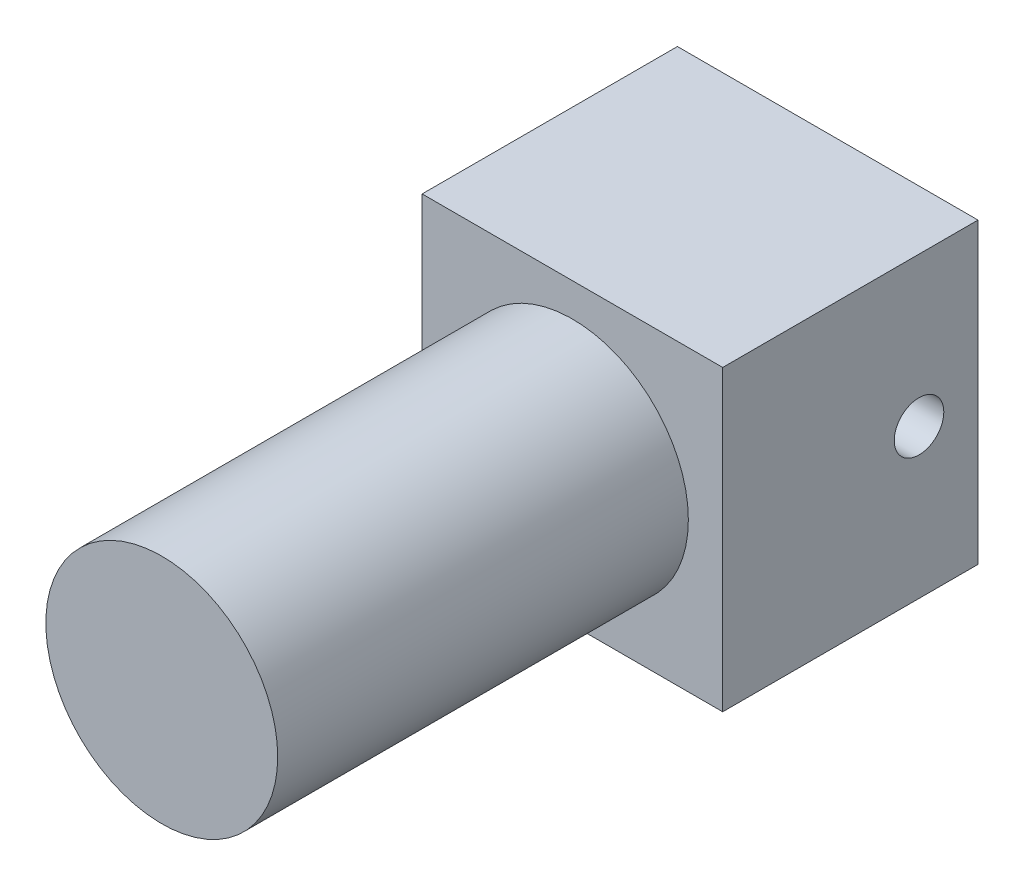
ISO-10303-21;
HEADER;
FILE_DESCRIPTION(('STEP AP214'),'2;1');
FILE_NAME('part.step','',(''),(''),'','','');
FILE_SCHEMA(('AUTOMOTIVE_DESIGN { 1 0 10303 214 1 1 1 1 }'));
ENDSEC;
DATA;
#1=APPLICATION_CONTEXT('core data for automotive mechanical design processes');
#2=APPLICATION_PROTOCOL_DEFINITION('international standard','automotive_design',2000,#1);
#3=PRODUCT_CONTEXT('',#1,'mechanical');
#4=PRODUCT('Part','Part','',(#3));
#5=PRODUCT_RELATED_PRODUCT_CATEGORY('part','',(#4));
#6=PRODUCT_DEFINITION_FORMATION('','',#4);
#7=PRODUCT_DEFINITION_CONTEXT('part definition',#1,'design');
#8=PRODUCT_DEFINITION('design','',#6,#7);
#9=PRODUCT_DEFINITION_SHAPE('','',#8);
#10=(LENGTH_UNIT() NAMED_UNIT(*) SI_UNIT(.MILLI.,.METRE.));
#11=(NAMED_UNIT(*) PLANE_ANGLE_UNIT() SI_UNIT($,.RADIAN.));
#12=(NAMED_UNIT(*) SI_UNIT($,.STERADIAN.) SOLID_ANGLE_UNIT());
#13=UNCERTAINTY_MEASURE_WITH_UNIT(LENGTH_MEASURE(1.E-05),#10,'distance_accuracy_value','');
#14=(GEOMETRIC_REPRESENTATION_CONTEXT(3) GLOBAL_UNCERTAINTY_ASSIGNED_CONTEXT((#13)) GLOBAL_UNIT_ASSIGNED_CONTEXT((#10,
#11,#12)) REPRESENTATION_CONTEXT('',''));
#15=CARTESIAN_POINT('',(0.,0.,0.));
#16=DIRECTION('',(0.,0.,1.));
#17=DIRECTION('',(1.,0.,0.));
#18=AXIS2_PLACEMENT_3D('',#15,#16,#17);
#19=CARTESIAN_POINT('',(19.25,-19.1,32.7));
#20=DIRECTION('',(-1.,0.,0.));
#21=DIRECTION('',(0.,0.,1.));
#22=AXIS2_PLACEMENT_3D('',#19,#20,#21);
#23=PLANE('',#22);
#24=CARTESIAN_POINT('',(19.25,0.,7.55431960739264));
#25=DIRECTION('',(1.,0.,0.));
#26=DIRECTION('',(0.,0.,-1.));
#27=AXIS2_PLACEMENT_3D('',#24,#25,#26);
#28=CIRCLE('',#27,3.175);
#29=CARTESIAN_POINT('',(19.25,0.,4.37931960739264));
#30=VERTEX_POINT('',#29);
#31=EDGE_CURVE('E135',#30,#30,#28,.T.);
#32=ORIENTED_EDGE('',*,*,#31,.F.);
#33=EDGE_LOOP('',(#32));
#34=FACE_BOUND('',#33,.T.);
#35=DIRECTION('',(0.,1.,0.));
#36=VECTOR('',#35,1.);
#37=CARTESIAN_POINT('',(19.25,-19.1,0.));
#38=LINE('',#37,#36);
#39=CARTESIAN_POINT('',(19.25,-19.1,0.));
#40=VERTEX_POINT('',#39);
#41=CARTESIAN_POINT('',(19.25,19.1,0.));
#42=VERTEX_POINT('',#41);
#43=EDGE_CURVE('E110',#40,#42,#38,.T.);
#44=ORIENTED_EDGE('',*,*,#43,.T.);
#45=DIRECTION('',(0.,0.,-1.));
#46=VECTOR('',#45,1.);
#47=CARTESIAN_POINT('',(19.25,19.1,32.7));
#48=LINE('',#47,#46);
#49=CARTESIAN_POINT('',(19.25,19.1,32.7));
#50=VERTEX_POINT('',#49);
#51=EDGE_CURVE('E42',#50,#42,#48,.T.);
#52=ORIENTED_EDGE('',*,*,#51,.F.);
#53=DIRECTION('',(0.,1.,0.));
#54=VECTOR('',#53,1.);
#55=CARTESIAN_POINT('',(19.25,-19.1,32.7));
#56=LINE('',#55,#54);
#57=CARTESIAN_POINT('',(19.25,-19.1,32.7));
#58=VERTEX_POINT('',#57);
#59=EDGE_CURVE('E93',#58,#50,#56,.T.);
#60=ORIENTED_EDGE('',*,*,#59,.F.);
#61=DIRECTION('',(0.,0.,-1.));
#62=VECTOR('',#61,1.);
#63=CARTESIAN_POINT('',(19.25,-19.1,32.7));
#64=LINE('',#63,#62);
#65=EDGE_CURVE('E106',#58,#40,#64,.T.);
#66=ORIENTED_EDGE('',*,*,#65,.T.);
#67=EDGE_LOOP('',(#44,#52,#60,#66));
#68=FACE_BOUND('',#67,.T.);
#69=ADVANCED_FACE('F39',(#34,#68),#23,.F.);
#70=CARTESIAN_POINT('',(-19.25,19.1,32.7));
#71=DIRECTION('',(0.,-1.,0.));
#72=DIRECTION('',(0.,0.,-1.));
#73=AXIS2_PLACEMENT_3D('',#70,#71,#72);
#74=PLANE('',#73);
#75=DIRECTION('',(-1.,0.,0.));
#76=VECTOR('',#75,1.);
#77=CARTESIAN_POINT('',(-19.25,19.1,0.));
#78=LINE('',#77,#76);
#79=CARTESIAN_POINT('',(-19.25,19.1,0.));
#80=VERTEX_POINT('',#79);
#81=EDGE_CURVE('E99',#42,#80,#78,.T.);
#82=ORIENTED_EDGE('',*,*,#81,.T.);
#83=DIRECTION('',(0.,0.,-1.));
#84=VECTOR('',#83,1.);
#85=CARTESIAN_POINT('',(-19.25,19.1,32.7));
#86=LINE('',#85,#84);
#87=CARTESIAN_POINT('',(-19.25,19.1,32.7));
#88=VERTEX_POINT('',#87);
#89=EDGE_CURVE('E97',#88,#80,#86,.T.);
#90=ORIENTED_EDGE('',*,*,#89,.F.);
#91=DIRECTION('',(-1.,0.,0.));
#92=VECTOR('',#91,1.);
#93=CARTESIAN_POINT('',(-19.25,19.1,32.7));
#94=LINE('',#93,#92);
#95=EDGE_CURVE('E88',#50,#88,#94,.T.);
#96=ORIENTED_EDGE('',*,*,#95,.F.);
#97=ORIENTED_EDGE('',*,*,#51,.T.);
#98=EDGE_LOOP('',(#82,#90,#96,#97));
#99=FACE_BOUND('',#98,.T.);
#100=ADVANCED_FACE('F98',(#99),#74,.F.);
#101=CARTESIAN_POINT('',(-19.25,-19.1,32.7));
#102=DIRECTION('',(1.,0.,0.));
#103=DIRECTION('',(0.,0.,-1.));
#104=AXIS2_PLACEMENT_3D('',#101,#102,#103);
#105=PLANE('',#104);
#106=CARTESIAN_POINT('',(-19.25,0.,7.55431960739264));
#107=DIRECTION('',(1.,0.,0.));
#108=DIRECTION('',(0.,0.,-1.));
#109=AXIS2_PLACEMENT_3D('',#106,#107,#108);
#110=CIRCLE('',#109,3.175);
#111=CARTESIAN_POINT('',(-19.25,0.,4.37931960739264));
#112=VERTEX_POINT('',#111);
#113=EDGE_CURVE('E143',#112,#112,#110,.T.);
#114=ORIENTED_EDGE('',*,*,#113,.T.);
#115=EDGE_LOOP('',(#114));
#116=FACE_BOUND('',#115,.T.);
#117=DIRECTION('',(0.,-1.,0.));
#118=VECTOR('',#117,1.);
#119=CARTESIAN_POINT('',(-19.25,-19.1,0.));
#120=LINE('',#119,#118);
#121=CARTESIAN_POINT('',(-19.25,-19.1,0.));
#122=VERTEX_POINT('',#121);
#123=EDGE_CURVE('E74',#80,#122,#120,.T.);
#124=ORIENTED_EDGE('',*,*,#123,.T.);
#125=DIRECTION('',(0.,0.,-1.));
#126=VECTOR('',#125,1.);
#127=CARTESIAN_POINT('',(-19.25,-19.1,32.7));
#128=LINE('',#127,#126);
#129=CARTESIAN_POINT('',(-19.25,-19.1,32.7));
#130=VERTEX_POINT('',#129);
#131=EDGE_CURVE('E101',#130,#122,#128,.T.);
#132=ORIENTED_EDGE('',*,*,#131,.F.);
#133=DIRECTION('',(0.,-1.,0.));
#134=VECTOR('',#133,1.);
#135=CARTESIAN_POINT('',(-19.25,-19.1,32.7));
#136=LINE('',#135,#134);
#137=EDGE_CURVE('E91',#88,#130,#136,.T.);
#138=ORIENTED_EDGE('',*,*,#137,.F.);
#139=ORIENTED_EDGE('',*,*,#89,.T.);
#140=EDGE_LOOP('',(#124,#132,#138,#139));
#141=FACE_BOUND('',#140,.T.);
#142=ADVANCED_FACE('F102',(#116,#141),#105,.F.);
#143=CARTESIAN_POINT('',(-19.25,-19.1,32.7));
#144=DIRECTION('',(0.,1.,0.));
#145=DIRECTION('',(0.,0.,1.));
#146=AXIS2_PLACEMENT_3D('',#143,#144,#145);
#147=PLANE('',#146);
#148=DIRECTION('',(1.,0.,0.));
#149=VECTOR('',#148,1.);
#150=CARTESIAN_POINT('',(-19.25,-19.1,0.));
#151=LINE('',#150,#149);
#152=EDGE_CURVE('E80',#122,#40,#151,.T.);
#153=ORIENTED_EDGE('',*,*,#152,.T.);
#154=ORIENTED_EDGE('',*,*,#65,.F.);
#155=DIRECTION('',(1.,0.,0.));
#156=VECTOR('',#155,1.);
#157=CARTESIAN_POINT('',(-19.25,-19.1,32.7));
#158=LINE('',#157,#156);
#159=EDGE_CURVE('E57',#130,#58,#158,.T.);
#160=ORIENTED_EDGE('',*,*,#159,.F.);
#161=ORIENTED_EDGE('',*,*,#131,.T.);
#162=EDGE_LOOP('',(#153,#154,#160,#161));
#163=FACE_BOUND('',#162,.T.);
#164=ADVANCED_FACE('F124',(#163),#147,.F.);
#165=CARTESIAN_POINT('',(0.,0.,32.7));
#166=DIRECTION('',(0.,0.,-1.));
#167=DIRECTION('',(-1.,0.,0.));
#168=AXIS2_PLACEMENT_3D('',#165,#166,#167);
#169=PLANE('',#168);
#170=CARTESIAN_POINT('',(0.,0.,32.7));
#171=DIRECTION('',(0.,0.,1.));
#172=DIRECTION('',(1.,0.,0.));
#173=AXIS2_PLACEMENT_3D('',#170,#171,#172);
#174=CIRCLE('',#173,14.85);
#175=CARTESIAN_POINT('',(14.85,0.,32.7));
#176=VERTEX_POINT('',#175);
#177=EDGE_CURVE('E11',#176,#176,#174,.T.);
#178=ORIENTED_EDGE('',*,*,#177,.F.);
#179=EDGE_LOOP('',(#178));
#180=FACE_BOUND('',#179,.T.);
#181=ORIENTED_EDGE('',*,*,#59,.T.);
#182=ORIENTED_EDGE('',*,*,#95,.T.);
#183=ORIENTED_EDGE('',*,*,#137,.T.);
#184=ORIENTED_EDGE('',*,*,#159,.T.);
#185=EDGE_LOOP('',(#181,#182,#183,#184));
#186=FACE_BOUND('',#185,.T.);
#187=ADVANCED_FACE('F89',(#180,#186),#169,.F.);
#188=CARTESIAN_POINT('',(0.,0.,0.));
#189=DIRECTION('',(0.,0.,-1.));
#190=DIRECTION('',(-1.,0.,0.));
#191=AXIS2_PLACEMENT_3D('',#188,#189,#190);
#192=PLANE('',#191);
#193=CARTESIAN_POINT('',(0.,-16.6516003268431,0.));
#194=DIRECTION('',(0.,0.,-1.));
#195=DIRECTION('',(-1.,0.,0.));
#196=AXIS2_PLACEMENT_3D('',#193,#194,#195);
#197=CIRCLE('',#196,2.06599733983125);
#198=CARTESIAN_POINT('',(-2.06599733983125,-16.6516003268431,0.));
#199=VERTEX_POINT('',#198);
#200=EDGE_CURVE('E151',#199,#199,#197,.T.);
#201=ORIENTED_EDGE('',*,*,#200,.F.);
#202=EDGE_LOOP('',(#201));
#203=FACE_BOUND('',#202,.T.);
#204=ORIENTED_EDGE('',*,*,#43,.F.);
#205=ORIENTED_EDGE('',*,*,#152,.F.);
#206=ORIENTED_EDGE('',*,*,#123,.F.);
#207=ORIENTED_EDGE('',*,*,#81,.F.);
#208=EDGE_LOOP('',(#204,#205,#206,#207));
#209=FACE_BOUND('',#208,.T.);
#210=ADVANCED_FACE('F127',(#203,#209),#192,.T.);
#211=CARTESIAN_POINT('',(0.,0.,85.3));
#212=DIRECTION('',(0.,0.,-1.));
#213=DIRECTION('',(-1.,0.,0.));
#214=AXIS2_PLACEMENT_3D('',#211,#212,#213);
#215=CYLINDRICAL_SURFACE('',#214,14.85);
#216=CARTESIAN_POINT('',(0.,0.,85.3));
#217=DIRECTION('',(0.,0.,1.));
#218=DIRECTION('',(1.,0.,0.));
#219=AXIS2_PLACEMENT_3D('',#216,#217,#218);
#220=CIRCLE('',#219,14.85);
#221=CARTESIAN_POINT('',(14.85,0.,85.3));
#222=VERTEX_POINT('',#221);
#223=EDGE_CURVE('E114',#222,#222,#220,.T.);
#224=ORIENTED_EDGE('',*,*,#223,.F.);
#225=EDGE_LOOP('',(#224));
#226=FACE_BOUND('',#225,.T.);
#227=ORIENTED_EDGE('',*,*,#177,.T.);
#228=EDGE_LOOP('',(#227));
#229=FACE_BOUND('',#228,.T.);
#230=ADVANCED_FACE('F169',(#226,#229),#215,.T.);
#231=CARTESIAN_POINT('',(0.,0.,85.3));
#232=DIRECTION('',(0.,0.,1.));
#233=DIRECTION('',(1.,0.,0.));
#234=AXIS2_PLACEMENT_3D('',#231,#232,#233);
#235=PLANE('',#234);
#236=ORIENTED_EDGE('',*,*,#223,.T.);
#237=EDGE_LOOP('',(#236));
#238=FACE_BOUND('',#237,.T.);
#239=ADVANCED_FACE('F176',(#238),#235,.T.);
#240=CARTESIAN_POINT('',(12.0364,0.,7.55431960739264));
#241=DIRECTION('',(1.,0.,0.));
#242=DIRECTION('',(0.,0.,-1.));
#243=AXIS2_PLACEMENT_3D('',#240,#241,#242);
#244=CYLINDRICAL_SURFACE('',#243,3.175);
#245=CARTESIAN_POINT('',(12.0364,0.,7.55431960739264));
#246=DIRECTION('',(1.,0.,0.));
#247=DIRECTION('',(0.,0.,-1.));
#248=AXIS2_PLACEMENT_3D('',#245,#246,#247);
#249=CIRCLE('',#248,3.175);
#250=CARTESIAN_POINT('',(12.0364,0.,4.37931960739264));
#251=VERTEX_POINT('',#250);
#252=EDGE_CURVE('E134',#251,#251,#249,.T.);
#253=ORIENTED_EDGE('',*,*,#252,.F.);
#254=EDGE_LOOP('',(#253));
#255=FACE_BOUND('',#254,.T.);
#256=ORIENTED_EDGE('',*,*,#31,.T.);
#257=EDGE_LOOP('',(#256));
#258=FACE_BOUND('',#257,.T.);
#259=ADVANCED_FACE('F192',(#255,#258),#244,.F.);
#260=CARTESIAN_POINT('',(12.0364,0.,7.55431960739264));
#261=DIRECTION('',(1.,0.,0.));
#262=DIRECTION('',(0.,0.,-1.));
#263=AXIS2_PLACEMENT_3D('',#260,#261,#262);
#264=PLANE('',#263);
#265=ORIENTED_EDGE('',*,*,#252,.T.);
#266=EDGE_LOOP('',(#265));
#267=FACE_BOUND('',#266,.T.);
#268=ADVANCED_FACE('F194',(#267),#264,.T.);
#269=CARTESIAN_POINT('',(-12.0364,0.,7.55431960739264));
#270=DIRECTION('',(-1.,0.,0.));
#271=DIRECTION('',(0.,0.,1.));
#272=AXIS2_PLACEMENT_3D('',#269,#270,#271);
#273=CYLINDRICAL_SURFACE('',#272,3.175);
#274=CARTESIAN_POINT('',(-12.0364,0.,7.55431960739264));
#275=DIRECTION('',(1.,0.,0.));
#276=DIRECTION('',(0.,0.,-1.));
#277=AXIS2_PLACEMENT_3D('',#274,#275,#276);
#278=CIRCLE('',#277,3.175);
#279=CARTESIAN_POINT('',(-12.0364,0.,4.37931960739264));
#280=VERTEX_POINT('',#279);
#281=EDGE_CURVE('E139',#280,#280,#278,.T.);
#282=ORIENTED_EDGE('',*,*,#281,.T.);
#283=EDGE_LOOP('',(#282));
#284=FACE_BOUND('',#283,.T.);
#285=ORIENTED_EDGE('',*,*,#113,.F.);
#286=EDGE_LOOP('',(#285));
#287=FACE_BOUND('',#286,.T.);
#288=ADVANCED_FACE('F200',(#284,#287),#273,.F.);
#289=CARTESIAN_POINT('',(-12.0364,0.,7.55431960739264));
#290=DIRECTION('',(-1.,0.,0.));
#291=DIRECTION('',(0.,0.,-1.));
#292=AXIS2_PLACEMENT_3D('',#289,#290,#291);
#293=PLANE('',#292);
#294=ORIENTED_EDGE('',*,*,#281,.F.);
#295=EDGE_LOOP('',(#294));
#296=FACE_BOUND('',#295,.T.);
#297=ADVANCED_FACE('F164',(#296),#293,.T.);
#298=CARTESIAN_POINT('',(0.,-16.6516003268431,-5.08));
#299=DIRECTION('',(0.,0.,1.));
#300=DIRECTION('',(1.,0.,0.));
#301=AXIS2_PLACEMENT_3D('',#298,#299,#300);
#302=CYLINDRICAL_SURFACE('',#301,2.06599733983125);
#303=CARTESIAN_POINT('',(0.,-16.6516003268431,-5.08));
#304=DIRECTION('',(0.,0.,-1.));
#305=DIRECTION('',(-1.,0.,0.));
#306=AXIS2_PLACEMENT_3D('',#303,#304,#305);
#307=CIRCLE('',#306,2.06599733983125);
#308=CARTESIAN_POINT('',(-2.06599733983125,-16.6516003268431,-5.08));
#309=VERTEX_POINT('',#308);
#310=EDGE_CURVE('E147',#309,#309,#307,.T.);
#311=ORIENTED_EDGE('',*,*,#310,.F.);
#312=EDGE_LOOP('',(#311));
#313=FACE_BOUND('',#312,.T.);
#314=ORIENTED_EDGE('',*,*,#200,.T.);
#315=EDGE_LOOP('',(#314));
#316=FACE_BOUND('',#315,.T.);
#317=ADVANCED_FACE('F161',(#313,#316),#302,.T.);
#318=CARTESIAN_POINT('',(0.,-16.6516003268431,-5.08));
#319=DIRECTION('',(0.,0.,-1.));
#320=DIRECTION('',(-1.,0.,0.));
#321=AXIS2_PLACEMENT_3D('',#318,#319,#320);
#322=PLANE('',#321);
#323=ORIENTED_EDGE('',*,*,#310,.T.);
#324=EDGE_LOOP('',(#323));
#325=FACE_BOUND('',#324,.T.);
#326=ADVANCED_FACE('F159',(#325),#322,.T.);
#327=CLOSED_SHELL('',(#69,#100,#142,#164,#187,#210,#230,#239,#259,#268,#288,#297,#317,#326));
#328=MANIFOLD_SOLID_BREP('B2',#327);
#329=ADVANCED_BREP_SHAPE_REPRESENTATION('',(#18,#328),#14);
#330=SHAPE_DEFINITION_REPRESENTATION(#9,#329);
ENDSEC;
END-ISO-10303-21;
